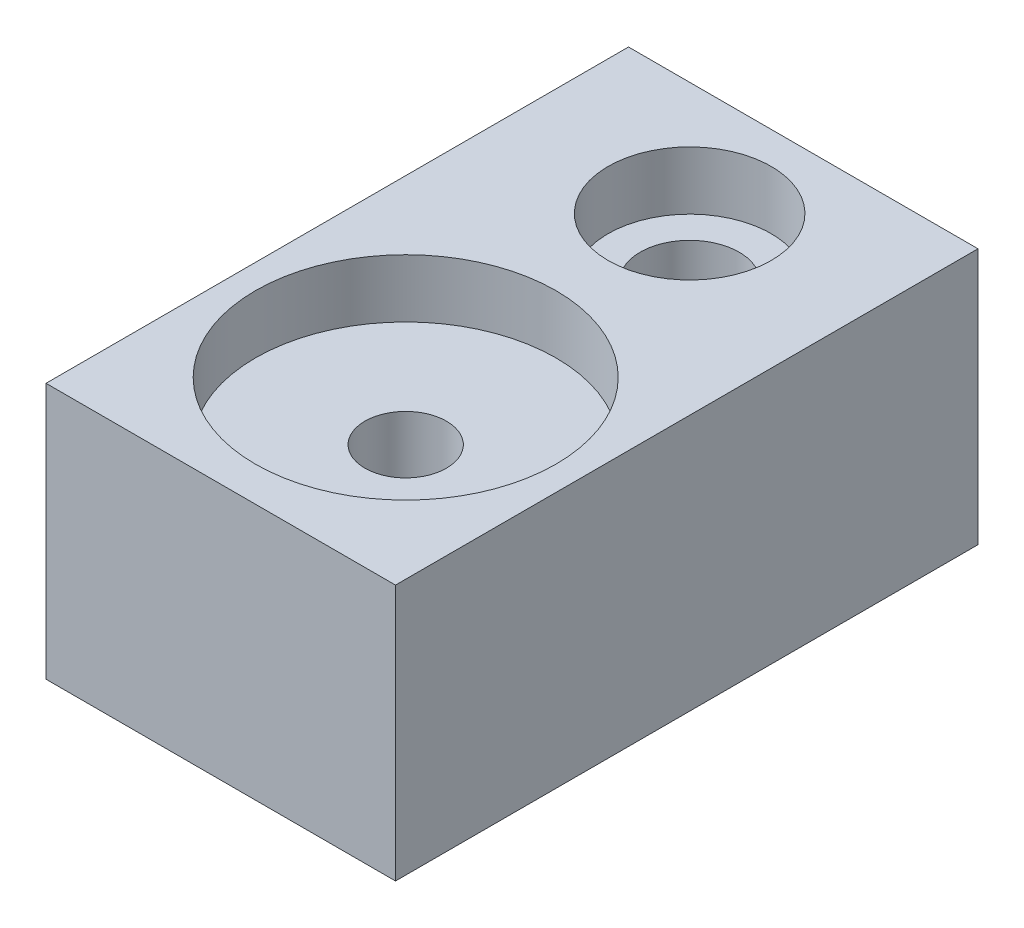
ISO-10303-21;
HEADER;
FILE_DESCRIPTION(('STEP AP214'),'2;1');
FILE_NAME('part.step','',(''),(''),'','','');
FILE_SCHEMA(('AUTOMOTIVE_DESIGN { 1 0 10303 214 1 1 1 1 }'));
ENDSEC;
DATA;
#1=APPLICATION_CONTEXT('core data for automotive mechanical design processes');
#2=APPLICATION_PROTOCOL_DEFINITION('international standard','automotive_design',2000,#1);
#3=PRODUCT_CONTEXT('',#1,'mechanical');
#4=PRODUCT('Part','Part','',(#3));
#5=PRODUCT_RELATED_PRODUCT_CATEGORY('part','',(#4));
#6=PRODUCT_DEFINITION_FORMATION('','',#4);
#7=PRODUCT_DEFINITION_CONTEXT('part definition',#1,'design');
#8=PRODUCT_DEFINITION('design','',#6,#7);
#9=PRODUCT_DEFINITION_SHAPE('','',#8);
#10=(LENGTH_UNIT() NAMED_UNIT(*) SI_UNIT(.MILLI.,.METRE.));
#11=(NAMED_UNIT(*) PLANE_ANGLE_UNIT() SI_UNIT($,.RADIAN.));
#12=(NAMED_UNIT(*) SI_UNIT($,.STERADIAN.) SOLID_ANGLE_UNIT());
#13=UNCERTAINTY_MEASURE_WITH_UNIT(LENGTH_MEASURE(1.E-05),#10,'distance_accuracy_value','');
#14=(GEOMETRIC_REPRESENTATION_CONTEXT(3) GLOBAL_UNCERTAINTY_ASSIGNED_CONTEXT((#13)) GLOBAL_UNIT_ASSIGNED_CONTEXT((#10,
#11,#12)) REPRESENTATION_CONTEXT('',''));
#15=CARTESIAN_POINT('',(0.,0.,0.));
#16=DIRECTION('',(0.,0.,1.));
#17=DIRECTION('',(1.,0.,0.));
#18=AXIS2_PLACEMENT_3D('',#15,#16,#17);
#19=CARTESIAN_POINT('',(0.,22.,-15.25));
#20=DIRECTION('',(0.,-1.,0.));
#21=DIRECTION('',(0.,0.,-1.));
#22=AXIS2_PLACEMENT_3D('',#19,#20,#21);
#23=CYLINDRICAL_SURFACE('',#22,4.25);
#24=CARTESIAN_POINT('',(0.,0.,-15.25));
#25=DIRECTION('',(0.,1.,0.));
#26=DIRECTION('',(0.,0.,1.));
#27=AXIS2_PLACEMENT_3D('',#24,#25,#26);
#28=CIRCLE('',#27,4.25);
#29=CARTESIAN_POINT('',(0.,0.,-11.));
#30=VERTEX_POINT('',#29);
#31=EDGE_CURVE('E107',#30,#30,#28,.T.);
#32=ORIENTED_EDGE('',*,*,#31,.F.);
#33=EDGE_LOOP('',(#32));
#34=FACE_BOUND('',#33,.T.);
#35=CARTESIAN_POINT('',(0.,17.,-15.25));
#36=DIRECTION('',(0.,1.,0.));
#37=DIRECTION('',(0.,0.,1.));
#38=AXIS2_PLACEMENT_3D('',#35,#36,#37);
#39=CIRCLE('',#38,4.25);
#40=CARTESIAN_POINT('',(0.,17.,-11.));
#41=VERTEX_POINT('',#40);
#42=EDGE_CURVE('E41',#41,#41,#39,.T.);
#43=ORIENTED_EDGE('',*,*,#42,.T.);
#44=EDGE_LOOP('',(#43));
#45=FACE_BOUND('',#44,.T.);
#46=ADVANCED_FACE('F37',(#34,#45),#23,.F.);
#47=CARTESIAN_POINT('',(0.,22.,9.12500000000001));
#48=DIRECTION('',(0.,-1.,0.));
#49=DIRECTION('',(0.,0.,-1.));
#50=AXIS2_PLACEMENT_3D('',#47,#48,#49);
#51=CYLINDRICAL_SURFACE('',#50,3.5);
#52=CARTESIAN_POINT('',(0.,17.,9.12500000000001));
#53=DIRECTION('',(0.,1.,0.));
#54=DIRECTION('',(0.,0.,1.));
#55=AXIS2_PLACEMENT_3D('',#52,#53,#54);
#56=CIRCLE('',#55,3.5);
#57=CARTESIAN_POINT('',(0.,17.,12.625));
#58=VERTEX_POINT('',#57);
#59=EDGE_CURVE('E113',#58,#58,#56,.T.);
#60=ORIENTED_EDGE('',*,*,#59,.T.);
#61=EDGE_LOOP('',(#60));
#62=FACE_BOUND('',#61,.T.);
#63=CARTESIAN_POINT('',(0.,3.5,9.12500000000001));
#64=DIRECTION('',(0.,-1.,0.));
#65=DIRECTION('',(0.,0.,-1.));
#66=AXIS2_PLACEMENT_3D('',#63,#64,#65);
#67=CIRCLE('',#66,3.5);
#68=CARTESIAN_POINT('',(0.,3.5,5.62500000000001));
#69=VERTEX_POINT('',#68);
#70=EDGE_CURVE('E116',#69,#69,#67,.T.);
#71=ORIENTED_EDGE('',*,*,#70,.T.);
#72=EDGE_LOOP('',(#71));
#73=FACE_BOUND('',#72,.T.);
#74=ADVANCED_FACE('F144',(#62,#73),#51,.F.);
#75=CARTESIAN_POINT('',(0.,22.,0.));
#76=DIRECTION('',(0.,1.,0.));
#77=DIRECTION('',(0.,0.,1.));
#78=AXIS2_PLACEMENT_3D('',#75,#76,#77);
#79=PLANE('',#78);
#80=CARTESIAN_POINT('',(0.,22.,-15.25));
#81=DIRECTION('',(0.,1.,0.));
#82=DIRECTION('',(0.,0.,1.));
#83=AXIS2_PLACEMENT_3D('',#80,#81,#82);
#84=CIRCLE('',#83,7.);
#85=CARTESIAN_POINT('',(0.,22.,-8.24999999999999));
#86=VERTEX_POINT('',#85);
#87=EDGE_CURVE('E132',#86,#86,#84,.T.);
#88=ORIENTED_EDGE('',*,*,#87,.F.);
#89=EDGE_LOOP('',(#88));
#90=FACE_BOUND('',#89,.T.);
#91=CARTESIAN_POINT('',(0.,22.,9.12500000000001));
#92=DIRECTION('',(0.,1.,0.));
#93=DIRECTION('',(0.,0.,1.));
#94=AXIS2_PLACEMENT_3D('',#91,#92,#93);
#95=CIRCLE('',#94,12.9);
#96=CARTESIAN_POINT('',(0.,22.,22.025));
#97=VERTEX_POINT('',#96);
#98=EDGE_CURVE('E118',#97,#97,#95,.T.);
#99=ORIENTED_EDGE('',*,*,#98,.F.);
#100=EDGE_LOOP('',(#99));
#101=FACE_BOUND('',#100,.T.);
#102=DIRECTION('',(0.,0.,-1.));
#103=VECTOR('',#102,1.);
#104=CARTESIAN_POINT('',(15.,22.,-25.));
#105=LINE('',#104,#103);
#106=CARTESIAN_POINT('',(15.,22.,25.));
#107=VERTEX_POINT('',#106);
#108=CARTESIAN_POINT('',(15.,22.,-25.));
#109=VERTEX_POINT('',#108);
#110=EDGE_CURVE('E91',#107,#109,#105,.T.);
#111=ORIENTED_EDGE('',*,*,#110,.T.);
#112=DIRECTION('',(-1.,0.,0.));
#113=VECTOR('',#112,1.);
#114=CARTESIAN_POINT('',(-15.,22.,-25.));
#115=LINE('',#114,#113);
#116=CARTESIAN_POINT('',(-15.,22.,-25.));
#117=VERTEX_POINT('',#116);
#118=EDGE_CURVE('E86',#109,#117,#115,.T.);
#119=ORIENTED_EDGE('',*,*,#118,.T.);
#120=DIRECTION('',(0.,0.,1.));
#121=VECTOR('',#120,1.);
#122=CARTESIAN_POINT('',(-15.,22.,-25.));
#123=LINE('',#122,#121);
#124=CARTESIAN_POINT('',(-15.,22.,25.));
#125=VERTEX_POINT('',#124);
#126=EDGE_CURVE('E89',#117,#125,#123,.T.);
#127=ORIENTED_EDGE('',*,*,#126,.T.);
#128=DIRECTION('',(1.,0.,0.));
#129=VECTOR('',#128,1.);
#130=CARTESIAN_POINT('',(-15.,22.,25.));
#131=LINE('',#130,#129);
#132=EDGE_CURVE('E56',#125,#107,#131,.T.);
#133=ORIENTED_EDGE('',*,*,#132,.T.);
#134=EDGE_LOOP('',(#111,#119,#127,#133));
#135=FACE_BOUND('',#134,.T.);
#136=ADVANCED_FACE('F87',(#90,#101,#135),#79,.T.);
#137=CARTESIAN_POINT('',(0.,0.,0.));
#138=DIRECTION('',(0.,1.,0.));
#139=DIRECTION('',(0.,0.,1.));
#140=AXIS2_PLACEMENT_3D('',#137,#138,#139);
#141=PLANE('',#140);
#142=CARTESIAN_POINT('',(0.,0.,9.12500000000001));
#143=DIRECTION('',(0.,-1.,0.));
#144=DIRECTION('',(0.,0.,-1.));
#145=AXIS2_PLACEMENT_3D('',#142,#143,#144);
#146=CIRCLE('',#145,6.);
#147=CARTESIAN_POINT('',(0.,0.,3.12500000000001));
#148=VERTEX_POINT('',#147);
#149=EDGE_CURVE('E125',#148,#148,#146,.T.);
#150=ORIENTED_EDGE('',*,*,#149,.F.);
#151=EDGE_LOOP('',(#150));
#152=FACE_BOUND('',#151,.T.);
#153=DIRECTION('',(0.,0.,-1.));
#154=VECTOR('',#153,1.);
#155=CARTESIAN_POINT('',(15.,0.,-25.));
#156=LINE('',#155,#154);
#157=CARTESIAN_POINT('',(15.,0.,25.));
#158=VERTEX_POINT('',#157);
#159=CARTESIAN_POINT('',(15.,0.,-25.));
#160=VERTEX_POINT('',#159);
#161=EDGE_CURVE('E104',#158,#160,#156,.T.);
#162=ORIENTED_EDGE('',*,*,#161,.F.);
#163=DIRECTION('',(1.,0.,0.));
#164=VECTOR('',#163,1.);
#165=CARTESIAN_POINT('',(-15.,0.,25.));
#166=LINE('',#165,#164);
#167=CARTESIAN_POINT('',(-15.,0.,25.));
#168=VERTEX_POINT('',#167);
#169=EDGE_CURVE('E79',#168,#158,#166,.T.);
#170=ORIENTED_EDGE('',*,*,#169,.F.);
#171=DIRECTION('',(0.,0.,1.));
#172=VECTOR('',#171,1.);
#173=CARTESIAN_POINT('',(-15.,0.,-25.));
#174=LINE('',#173,#172);
#175=CARTESIAN_POINT('',(-15.,0.,-25.));
#176=VERTEX_POINT('',#175);
#177=EDGE_CURVE('E73',#176,#168,#174,.T.);
#178=ORIENTED_EDGE('',*,*,#177,.F.);
#179=DIRECTION('',(-1.,0.,0.));
#180=VECTOR('',#179,1.);
#181=CARTESIAN_POINT('',(-15.,0.,-25.));
#182=LINE('',#181,#180);
#183=EDGE_CURVE('E95',#160,#176,#182,.T.);
#184=ORIENTED_EDGE('',*,*,#183,.F.);
#185=EDGE_LOOP('',(#162,#170,#178,#184));
#186=FACE_BOUND('',#185,.T.);
#187=ORIENTED_EDGE('',*,*,#31,.T.);
#188=EDGE_LOOP('',(#187));
#189=FACE_BOUND('',#188,.T.);
#190=ADVANCED_FACE('F140',(#152,#186,#189),#141,.F.);
#191=CARTESIAN_POINT('',(15.,22.,-25.));
#192=DIRECTION('',(-1.,0.,0.));
#193=DIRECTION('',(0.,0.,1.));
#194=AXIS2_PLACEMENT_3D('',#191,#192,#193);
#195=PLANE('',#194);
#196=ORIENTED_EDGE('',*,*,#161,.T.);
#197=DIRECTION('',(0.,-1.,0.));
#198=VECTOR('',#197,1.);
#199=CARTESIAN_POINT('',(15.,22.,-25.));
#200=LINE('',#199,#198);
#201=EDGE_CURVE('E11',#109,#160,#200,.T.);
#202=ORIENTED_EDGE('',*,*,#201,.F.);
#203=ORIENTED_EDGE('',*,*,#110,.F.);
#204=DIRECTION('',(0.,-1.,0.));
#205=VECTOR('',#204,1.);
#206=CARTESIAN_POINT('',(15.,22.,25.));
#207=LINE('',#206,#205);
#208=EDGE_CURVE('E100',#107,#158,#207,.T.);
#209=ORIENTED_EDGE('',*,*,#208,.T.);
#210=EDGE_LOOP('',(#196,#202,#203,#209));
#211=FACE_BOUND('',#210,.T.);
#212=ADVANCED_FACE('F39',(#211),#195,.F.);
#213=CARTESIAN_POINT('',(-15.,22.,-25.));
#214=DIRECTION('',(0.,0.,1.));
#215=DIRECTION('',(1.,0.,0.));
#216=AXIS2_PLACEMENT_3D('',#213,#214,#215);
#217=PLANE('',#216);
#218=ORIENTED_EDGE('',*,*,#183,.T.);
#219=DIRECTION('',(0.,-1.,0.));
#220=VECTOR('',#219,1.);
#221=CARTESIAN_POINT('',(-15.,22.,-25.));
#222=LINE('',#221,#220);
#223=EDGE_CURVE('E47',#117,#176,#222,.T.);
#224=ORIENTED_EDGE('',*,*,#223,.F.);
#225=ORIENTED_EDGE('',*,*,#118,.F.);
#226=ORIENTED_EDGE('',*,*,#201,.T.);
#227=EDGE_LOOP('',(#218,#224,#225,#226));
#228=FACE_BOUND('',#227,.T.);
#229=ADVANCED_FACE('F94',(#228),#217,.F.);
#230=CARTESIAN_POINT('',(-15.,22.,-25.));
#231=DIRECTION('',(1.,0.,0.));
#232=DIRECTION('',(0.,0.,-1.));
#233=AXIS2_PLACEMENT_3D('',#230,#231,#232);
#234=PLANE('',#233);
#235=ORIENTED_EDGE('',*,*,#177,.T.);
#236=DIRECTION('',(0.,-1.,0.));
#237=VECTOR('',#236,1.);
#238=CARTESIAN_POINT('',(-15.,22.,25.));
#239=LINE('',#238,#237);
#240=EDGE_CURVE('E96',#125,#168,#239,.T.);
#241=ORIENTED_EDGE('',*,*,#240,.F.);
#242=ORIENTED_EDGE('',*,*,#126,.F.);
#243=ORIENTED_EDGE('',*,*,#223,.T.);
#244=EDGE_LOOP('',(#235,#241,#242,#243));
#245=FACE_BOUND('',#244,.T.);
#246=ADVANCED_FACE('F98',(#245),#234,.F.);
#247=CARTESIAN_POINT('',(-15.,22.,25.));
#248=DIRECTION('',(0.,0.,-1.));
#249=DIRECTION('',(-1.,0.,0.));
#250=AXIS2_PLACEMENT_3D('',#247,#248,#249);
#251=PLANE('',#250);
#252=ORIENTED_EDGE('',*,*,#169,.T.);
#253=ORIENTED_EDGE('',*,*,#208,.F.);
#254=ORIENTED_EDGE('',*,*,#132,.F.);
#255=ORIENTED_EDGE('',*,*,#240,.T.);
#256=EDGE_LOOP('',(#252,#253,#254,#255));
#257=FACE_BOUND('',#256,.T.);
#258=ADVANCED_FACE('F166',(#257),#251,.F.);
#259=CARTESIAN_POINT('',(0.,17.,9.12500000000001));
#260=DIRECTION('',(0.,1.,0.));
#261=DIRECTION('',(0.,0.,1.));
#262=AXIS2_PLACEMENT_3D('',#259,#260,#261);
#263=CYLINDRICAL_SURFACE('',#262,12.9);
#264=CARTESIAN_POINT('',(0.,17.,9.12500000000001));
#265=DIRECTION('',(0.,1.,0.));
#266=DIRECTION('',(0.,0.,1.));
#267=AXIS2_PLACEMENT_3D('',#264,#265,#266);
#268=CIRCLE('',#267,12.9);
#269=CARTESIAN_POINT('',(0.,17.,22.025));
#270=VERTEX_POINT('',#269);
#271=EDGE_CURVE('E115',#270,#270,#268,.T.);
#272=ORIENTED_EDGE('',*,*,#271,.F.);
#273=EDGE_LOOP('',(#272));
#274=FACE_BOUND('',#273,.T.);
#275=ORIENTED_EDGE('',*,*,#98,.T.);
#276=EDGE_LOOP('',(#275));
#277=FACE_BOUND('',#276,.T.);
#278=ADVANCED_FACE('F163',(#274,#277),#263,.F.);
#279=CARTESIAN_POINT('',(0.,17.,9.12500000000001));
#280=DIRECTION('',(0.,1.,0.));
#281=DIRECTION('',(0.,0.,1.));
#282=AXIS2_PLACEMENT_3D('',#279,#280,#281);
#283=PLANE('',#282);
#284=ORIENTED_EDGE('',*,*,#59,.F.);
#285=EDGE_LOOP('',(#284));
#286=FACE_BOUND('',#285,.T.);
#287=ORIENTED_EDGE('',*,*,#271,.T.);
#288=EDGE_LOOP('',(#287));
#289=FACE_BOUND('',#288,.T.);
#290=ADVANCED_FACE('F165',(#286,#289),#283,.T.);
#291=CARTESIAN_POINT('',(0.,3.5,9.12500000000001));
#292=DIRECTION('',(0.,-1.,0.));
#293=DIRECTION('',(0.,0.,-1.));
#294=AXIS2_PLACEMENT_3D('',#291,#292,#293);
#295=CYLINDRICAL_SURFACE('',#294,6.);
#296=CARTESIAN_POINT('',(0.,3.5,9.12500000000001));
#297=DIRECTION('',(0.,-1.,0.));
#298=DIRECTION('',(0.,0.,-1.));
#299=AXIS2_PLACEMENT_3D('',#296,#297,#298);
#300=CIRCLE('',#299,6.);
#301=CARTESIAN_POINT('',(0.,3.5,3.12500000000001));
#302=VERTEX_POINT('',#301);
#303=EDGE_CURVE('E119',#302,#302,#300,.T.);
#304=ORIENTED_EDGE('',*,*,#303,.F.);
#305=EDGE_LOOP('',(#304));
#306=FACE_BOUND('',#305,.T.);
#307=ORIENTED_EDGE('',*,*,#149,.T.);
#308=EDGE_LOOP('',(#307));
#309=FACE_BOUND('',#308,.T.);
#310=ADVANCED_FACE('F173',(#306,#309),#295,.F.);
#311=CARTESIAN_POINT('',(0.,3.5,9.12500000000001));
#312=DIRECTION('',(0.,-1.,0.));
#313=DIRECTION('',(0.,0.,-1.));
#314=AXIS2_PLACEMENT_3D('',#311,#312,#313);
#315=PLANE('',#314);
#316=ORIENTED_EDGE('',*,*,#70,.F.);
#317=EDGE_LOOP('',(#316));
#318=FACE_BOUND('',#317,.T.);
#319=ORIENTED_EDGE('',*,*,#303,.T.);
#320=EDGE_LOOP('',(#319));
#321=FACE_BOUND('',#320,.T.);
#322=ADVANCED_FACE('F222',(#318,#321),#315,.T.);
#323=CARTESIAN_POINT('',(0.,17.,-15.25));
#324=DIRECTION('',(0.,1.,0.));
#325=DIRECTION('',(0.,0.,1.));
#326=AXIS2_PLACEMENT_3D('',#323,#324,#325);
#327=CYLINDRICAL_SURFACE('',#326,7.);
#328=CARTESIAN_POINT('',(0.,17.,-15.25));
#329=DIRECTION('',(0.,1.,0.));
#330=DIRECTION('',(0.,0.,1.));
#331=AXIS2_PLACEMENT_3D('',#328,#329,#330);
#332=CIRCLE('',#331,7.);
#333=CARTESIAN_POINT('',(0.,17.,-8.24999999999999));
#334=VERTEX_POINT('',#333);
#335=EDGE_CURVE('E149',#334,#334,#332,.T.);
#336=ORIENTED_EDGE('',*,*,#335,.F.);
#337=EDGE_LOOP('',(#336));
#338=FACE_BOUND('',#337,.T.);
#339=ORIENTED_EDGE('',*,*,#87,.T.);
#340=EDGE_LOOP('',(#339));
#341=FACE_BOUND('',#340,.T.);
#342=ADVANCED_FACE('F156',(#338,#341),#327,.F.);
#343=CARTESIAN_POINT('',(0.,17.,-15.25));
#344=DIRECTION('',(0.,1.,0.));
#345=DIRECTION('',(0.,0.,1.));
#346=AXIS2_PLACEMENT_3D('',#343,#344,#345);
#347=PLANE('',#346);
#348=ORIENTED_EDGE('',*,*,#42,.F.);
#349=EDGE_LOOP('',(#348));
#350=FACE_BOUND('',#349,.T.);
#351=ORIENTED_EDGE('',*,*,#335,.T.);
#352=EDGE_LOOP('',(#351));
#353=FACE_BOUND('',#352,.T.);
#354=ADVANCED_FACE('F274',(#350,#353),#347,.T.);
#355=CLOSED_SHELL('',(#46,#74,#136,#190,#212,#229,#246,#258,#278,#290,#310,#322,#342,#354));
#356=MANIFOLD_SOLID_BREP('B2',#355);
#357=ADVANCED_BREP_SHAPE_REPRESENTATION('',(#18,#356),#14);
#358=SHAPE_DEFINITION_REPRESENTATION(#9,#357);
ENDSEC;
END-ISO-10303-21;
